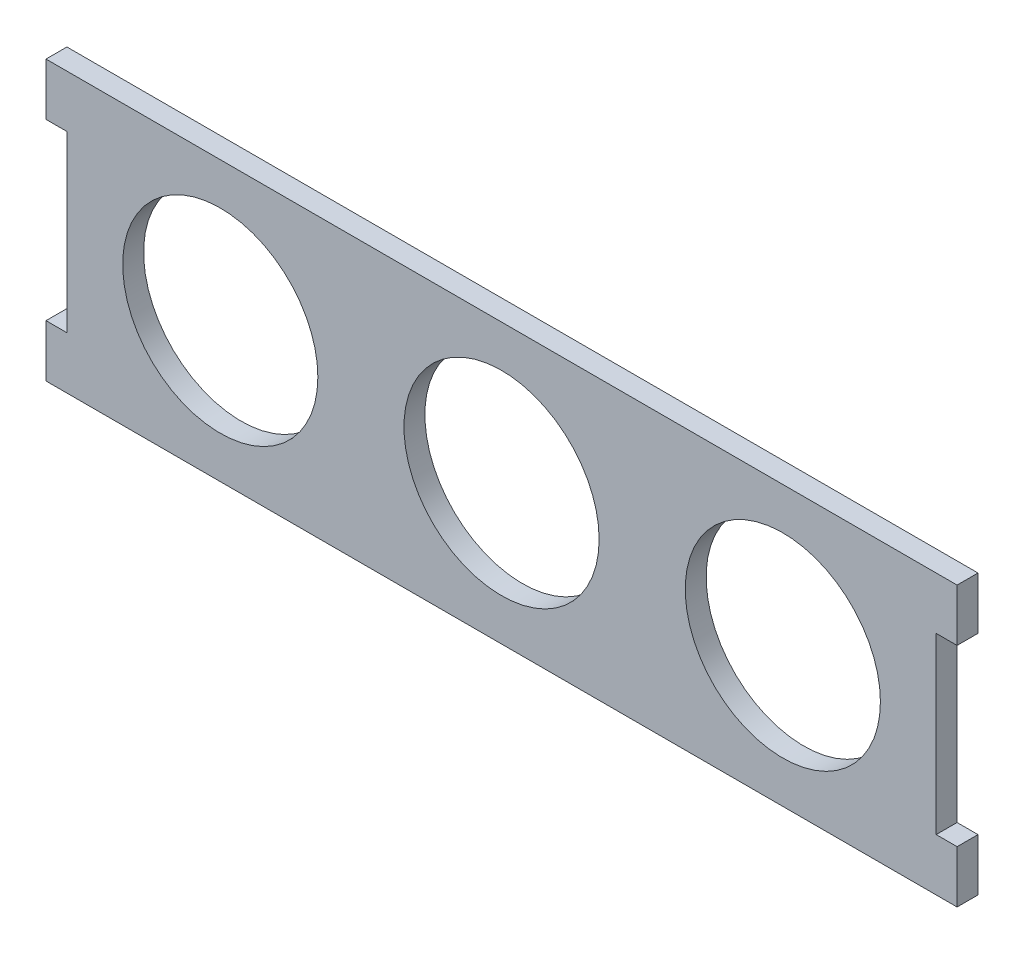
ISO-10303-21;
HEADER;
FILE_DESCRIPTION(('STEP AP214'),'2;1');
FILE_NAME('part.step','',(''),(''),'','','');
FILE_SCHEMA(('AUTOMOTIVE_DESIGN { 1 0 10303 214 1 1 1 1 }'));
ENDSEC;
DATA;
#1=APPLICATION_CONTEXT('core data for automotive mechanical design processes');
#2=APPLICATION_PROTOCOL_DEFINITION('international standard','automotive_design',2000,#1);
#3=PRODUCT_CONTEXT('',#1,'mechanical');
#4=PRODUCT('Part','Part','',(#3));
#5=PRODUCT_RELATED_PRODUCT_CATEGORY('part','',(#4));
#6=PRODUCT_DEFINITION_FORMATION('','',#4);
#7=PRODUCT_DEFINITION_CONTEXT('part definition',#1,'design');
#8=PRODUCT_DEFINITION('design','',#6,#7);
#9=PRODUCT_DEFINITION_SHAPE('','',#8);
#10=(LENGTH_UNIT() NAMED_UNIT(*) SI_UNIT(.MILLI.,.METRE.));
#11=(NAMED_UNIT(*) PLANE_ANGLE_UNIT() SI_UNIT($,.RADIAN.));
#12=(NAMED_UNIT(*) SI_UNIT($,.STERADIAN.) SOLID_ANGLE_UNIT());
#13=UNCERTAINTY_MEASURE_WITH_UNIT(LENGTH_MEASURE(1.E-05),#10,'distance_accuracy_value','');
#14=(GEOMETRIC_REPRESENTATION_CONTEXT(3) GLOBAL_UNCERTAINTY_ASSIGNED_CONTEXT((#13)) GLOBAL_UNIT_ASSIGNED_CONTEXT((#10,
#11,#12)) REPRESENTATION_CONTEXT('',''));
#15=CARTESIAN_POINT('',(0.,0.,0.));
#16=DIRECTION('',(0.,0.,1.));
#17=DIRECTION('',(1.,0.,0.));
#18=AXIS2_PLACEMENT_3D('',#15,#16,#17);
#19=CARTESIAN_POINT('',(3.,0.,3.));
#20=DIRECTION('',(1.,0.,0.));
#21=DIRECTION('',(0.,1.,0.));
#22=AXIS2_PLACEMENT_3D('',#19,#20,#21);
#23=PLANE('',#22);
#24=DIRECTION('',(0.,-1.,0.));
#25=VECTOR('',#24,1.);
#26=CARTESIAN_POINT('',(3.,0.,0.));
#27=LINE('',#26,#25);
#28=CARTESIAN_POINT('',(3.,-7.5,0.));
#29=VERTEX_POINT('',#28);
#30=CARTESIAN_POINT('',(3.,-32.5,0.));
#31=VERTEX_POINT('',#30);
#32=EDGE_CURVE('E169',#29,#31,#27,.T.);
#33=ORIENTED_EDGE('',*,*,#32,.T.);
#34=DIRECTION('',(0.,0.,-1.));
#35=VECTOR('',#34,1.);
#36=CARTESIAN_POINT('',(3.,-32.5,3.));
#37=LINE('',#36,#35);
#38=CARTESIAN_POINT('',(3.,-32.5,3.));
#39=VERTEX_POINT('',#38);
#40=EDGE_CURVE('E11',#39,#31,#37,.T.);
#41=ORIENTED_EDGE('',*,*,#40,.F.);
#42=DIRECTION('',(0.,-1.,0.));
#43=VECTOR('',#42,1.);
#44=CARTESIAN_POINT('',(3.,0.,3.));
#45=LINE('',#44,#43);
#46=CARTESIAN_POINT('',(3.,-7.5,3.));
#47=VERTEX_POINT('',#46);
#48=EDGE_CURVE('E106',#47,#39,#45,.T.);
#49=ORIENTED_EDGE('',*,*,#48,.F.);
#50=DIRECTION('',(0.,0.,-1.));
#51=VECTOR('',#50,1.);
#52=CARTESIAN_POINT('',(3.,-7.5,3.));
#53=LINE('',#52,#51);
#54=EDGE_CURVE('E159',#47,#29,#53,.T.);
#55=ORIENTED_EDGE('',*,*,#54,.T.);
#56=EDGE_LOOP('',(#33,#41,#49,#55));
#57=FACE_BOUND('',#56,.T.);
#58=ADVANCED_FACE('F38',(#57),#23,.F.);
#59=CARTESIAN_POINT('',(0.,-32.5,3.));
#60=DIRECTION('',(0.,1.,0.));
#61=DIRECTION('',(0.,0.,1.));
#62=AXIS2_PLACEMENT_3D('',#59,#60,#61);
#63=PLANE('',#62);
#64=DIRECTION('',(1.,0.,0.));
#65=VECTOR('',#64,1.);
#66=CARTESIAN_POINT('',(0.,-32.5,0.));
#67=LINE('',#66,#65);
#68=CARTESIAN_POINT('',(0.,-32.5,0.));
#69=VERTEX_POINT('',#68);
#70=EDGE_CURVE('E172',#69,#31,#67,.T.);
#71=ORIENTED_EDGE('',*,*,#70,.F.);
#72=DIRECTION('',(0.,0.,-1.));
#73=VECTOR('',#72,1.);
#74=CARTESIAN_POINT('',(0.,-32.5,3.));
#75=LINE('',#74,#73);
#76=CARTESIAN_POINT('',(0.,-32.5,3.));
#77=VERTEX_POINT('',#76);
#78=EDGE_CURVE('E47',#77,#69,#75,.T.);
#79=ORIENTED_EDGE('',*,*,#78,.F.);
#80=DIRECTION('',(1.,0.,0.));
#81=VECTOR('',#80,1.);
#82=CARTESIAN_POINT('',(0.,-32.5,3.));
#83=LINE('',#82,#81);
#84=EDGE_CURVE('E228',#77,#39,#83,.T.);
#85=ORIENTED_EDGE('',*,*,#84,.T.);
#86=ORIENTED_EDGE('',*,*,#40,.T.);
#87=EDGE_LOOP('',(#71,#79,#85,#86));
#88=FACE_BOUND('',#87,.T.);
#89=ADVANCED_FACE('F227',(#88),#63,.T.);
#90=CARTESIAN_POINT('',(0.,0.,3.));
#91=DIRECTION('',(1.,0.,0.));
#92=DIRECTION('',(0.,1.,0.));
#93=AXIS2_PLACEMENT_3D('',#90,#91,#92);
#94=PLANE('',#93);
#95=DIRECTION('',(0.,-1.,0.));
#96=VECTOR('',#95,1.);
#97=CARTESIAN_POINT('',(0.,0.,0.));
#98=LINE('',#97,#96);
#99=CARTESIAN_POINT('',(0.,-40.,0.));
#100=VERTEX_POINT('',#99);
#101=EDGE_CURVE('E175',#69,#100,#98,.T.);
#102=ORIENTED_EDGE('',*,*,#101,.T.);
#103=DIRECTION('',(0.,0.,-1.));
#104=VECTOR('',#103,1.);
#105=CARTESIAN_POINT('',(0.,-40.,3.));
#106=LINE('',#105,#104);
#107=CARTESIAN_POINT('',(0.,-40.,3.));
#108=VERTEX_POINT('',#107);
#109=EDGE_CURVE('E212',#108,#100,#106,.T.);
#110=ORIENTED_EDGE('',*,*,#109,.F.);
#111=DIRECTION('',(0.,-1.,0.));
#112=VECTOR('',#111,1.);
#113=CARTESIAN_POINT('',(0.,0.,3.));
#114=LINE('',#113,#112);
#115=EDGE_CURVE('E219',#77,#108,#114,.T.);
#116=ORIENTED_EDGE('',*,*,#115,.F.);
#117=ORIENTED_EDGE('',*,*,#78,.T.);
#118=EDGE_LOOP('',(#102,#110,#116,#117));
#119=FACE_BOUND('',#118,.T.);
#120=ADVANCED_FACE('F217',(#119),#94,.F.);
#121=CARTESIAN_POINT('',(0.,-40.,3.));
#122=DIRECTION('',(0.,1.,0.));
#123=DIRECTION('',(0.,0.,1.));
#124=AXIS2_PLACEMENT_3D('',#121,#122,#123);
#125=PLANE('',#124);
#126=DIRECTION('',(1.,0.,0.));
#127=VECTOR('',#126,1.);
#128=CARTESIAN_POINT('',(0.,-40.,0.));
#129=LINE('',#128,#127);
#130=CARTESIAN_POINT('',(130.7,-40.,0.));
#131=VERTEX_POINT('',#130);
#132=EDGE_CURVE('E177',#100,#131,#129,.T.);
#133=ORIENTED_EDGE('',*,*,#132,.T.);
#134=DIRECTION('',(0.,0.,-1.));
#135=VECTOR('',#134,1.);
#136=CARTESIAN_POINT('',(130.7,-40.,3.));
#137=LINE('',#136,#135);
#138=CARTESIAN_POINT('',(130.7,-40.,3.));
#139=VERTEX_POINT('',#138);
#140=EDGE_CURVE('E210',#139,#131,#137,.T.);
#141=ORIENTED_EDGE('',*,*,#140,.F.);
#142=DIRECTION('',(1.,0.,0.));
#143=VECTOR('',#142,1.);
#144=CARTESIAN_POINT('',(0.,-40.,3.));
#145=LINE('',#144,#143);
#146=EDGE_CURVE('E256',#108,#139,#145,.T.);
#147=ORIENTED_EDGE('',*,*,#146,.F.);
#148=ORIENTED_EDGE('',*,*,#109,.T.);
#149=EDGE_LOOP('',(#133,#141,#147,#148));
#150=FACE_BOUND('',#149,.T.);
#151=ADVANCED_FACE('F255',(#150),#125,.F.);
#152=CARTESIAN_POINT('',(130.7,0.,3.));
#153=DIRECTION('',(1.,0.,0.));
#154=DIRECTION('',(0.,0.,-1.));
#155=AXIS2_PLACEMENT_3D('',#152,#153,#154);
#156=PLANE('',#155);
#157=DIRECTION('',(0.,-1.,0.));
#158=VECTOR('',#157,1.);
#159=CARTESIAN_POINT('',(130.7,0.,0.));
#160=LINE('',#159,#158);
#161=CARTESIAN_POINT('',(130.7,-32.5,0.));
#162=VERTEX_POINT('',#161);
#163=EDGE_CURVE('E180',#162,#131,#160,.T.);
#164=ORIENTED_EDGE('',*,*,#163,.F.);
#165=DIRECTION('',(0.,0.,-1.));
#166=VECTOR('',#165,1.);
#167=CARTESIAN_POINT('',(130.7,-32.5,3.));
#168=LINE('',#167,#166);
#169=CARTESIAN_POINT('',(130.7,-32.5,3.));
#170=VERTEX_POINT('',#169);
#171=EDGE_CURVE('E208',#170,#162,#168,.T.);
#172=ORIENTED_EDGE('',*,*,#171,.F.);
#173=DIRECTION('',(0.,-1.,0.));
#174=VECTOR('',#173,1.);
#175=CARTESIAN_POINT('',(130.7,0.,3.));
#176=LINE('',#175,#174);
#177=EDGE_CURVE('E252',#170,#139,#176,.T.);
#178=ORIENTED_EDGE('',*,*,#177,.T.);
#179=ORIENTED_EDGE('',*,*,#140,.T.);
#180=EDGE_LOOP('',(#164,#172,#178,#179));
#181=FACE_BOUND('',#180,.T.);
#182=ADVANCED_FACE('F247',(#181),#156,.T.);
#183=CARTESIAN_POINT('',(0.,-32.5,3.));
#184=DIRECTION('',(0.,-1.,0.));
#185=DIRECTION('',(0.,0.,-1.));
#186=AXIS2_PLACEMENT_3D('',#183,#184,#185);
#187=PLANE('',#186);
#188=DIRECTION('',(-1.,0.,0.));
#189=VECTOR('',#188,1.);
#190=CARTESIAN_POINT('',(0.,-32.5,0.));
#191=LINE('',#190,#189);
#192=CARTESIAN_POINT('',(127.7,-32.5,0.));
#193=VERTEX_POINT('',#192);
#194=EDGE_CURVE('E183',#162,#193,#191,.T.);
#195=ORIENTED_EDGE('',*,*,#194,.T.);
#196=DIRECTION('',(0.,0.,-1.));
#197=VECTOR('',#196,1.);
#198=CARTESIAN_POINT('',(127.7,-32.5,3.));
#199=LINE('',#198,#197);
#200=CARTESIAN_POINT('',(127.7,-32.5,3.));
#201=VERTEX_POINT('',#200);
#202=EDGE_CURVE('E206',#201,#193,#199,.T.);
#203=ORIENTED_EDGE('',*,*,#202,.F.);
#204=DIRECTION('',(-1.,0.,0.));
#205=VECTOR('',#204,1.);
#206=CARTESIAN_POINT('',(0.,-32.5,3.));
#207=LINE('',#206,#205);
#208=EDGE_CURVE('E258',#170,#201,#207,.T.);
#209=ORIENTED_EDGE('',*,*,#208,.F.);
#210=ORIENTED_EDGE('',*,*,#171,.T.);
#211=EDGE_LOOP('',(#195,#203,#209,#210));
#212=FACE_BOUND('',#211,.T.);
#213=ADVANCED_FACE('F265',(#212),#187,.F.);
#214=CARTESIAN_POINT('',(127.7,0.,3.));
#215=DIRECTION('',(1.,0.,0.));
#216=DIRECTION('',(0.,0.,-1.));
#217=AXIS2_PLACEMENT_3D('',#214,#215,#216);
#218=PLANE('',#217);
#219=DIRECTION('',(0.,-1.,0.));
#220=VECTOR('',#219,1.);
#221=CARTESIAN_POINT('',(127.7,0.,0.));
#222=LINE('',#221,#220);
#223=CARTESIAN_POINT('',(127.7,-7.5,0.));
#224=VERTEX_POINT('',#223);
#225=EDGE_CURVE('E186',#224,#193,#222,.T.);
#226=ORIENTED_EDGE('',*,*,#225,.F.);
#227=DIRECTION('',(0.,0.,-1.));
#228=VECTOR('',#227,1.);
#229=CARTESIAN_POINT('',(127.7,-7.5,3.));
#230=LINE('',#229,#228);
#231=CARTESIAN_POINT('',(127.7,-7.5,3.));
#232=VERTEX_POINT('',#231);
#233=EDGE_CURVE('E204',#232,#224,#230,.T.);
#234=ORIENTED_EDGE('',*,*,#233,.F.);
#235=DIRECTION('',(0.,-1.,0.));
#236=VECTOR('',#235,1.);
#237=CARTESIAN_POINT('',(127.7,0.,3.));
#238=LINE('',#237,#236);
#239=EDGE_CURVE('E264',#232,#201,#238,.T.);
#240=ORIENTED_EDGE('',*,*,#239,.T.);
#241=ORIENTED_EDGE('',*,*,#202,.T.);
#242=EDGE_LOOP('',(#226,#234,#240,#241));
#243=FACE_BOUND('',#242,.T.);
#244=ADVANCED_FACE('F241',(#243),#218,.T.);
#245=CARTESIAN_POINT('',(0.,-7.5,3.));
#246=DIRECTION('',(0.,-1.,0.));
#247=DIRECTION('',(0.,0.,-1.));
#248=AXIS2_PLACEMENT_3D('',#245,#246,#247);
#249=PLANE('',#248);
#250=DIRECTION('',(-1.,0.,0.));
#251=VECTOR('',#250,1.);
#252=CARTESIAN_POINT('',(0.,-7.5,0.));
#253=LINE('',#252,#251);
#254=CARTESIAN_POINT('',(130.7,-7.5,0.));
#255=VERTEX_POINT('',#254);
#256=EDGE_CURVE('E189',#255,#224,#253,.T.);
#257=ORIENTED_EDGE('',*,*,#256,.F.);
#258=DIRECTION('',(0.,0.,-1.));
#259=VECTOR('',#258,1.);
#260=CARTESIAN_POINT('',(130.7,-7.5,3.));
#261=LINE('',#260,#259);
#262=CARTESIAN_POINT('',(130.7,-7.5,3.));
#263=VERTEX_POINT('',#262);
#264=EDGE_CURVE('E202',#263,#255,#261,.T.);
#265=ORIENTED_EDGE('',*,*,#264,.F.);
#266=DIRECTION('',(-1.,0.,0.));
#267=VECTOR('',#266,1.);
#268=CARTESIAN_POINT('',(0.,-7.5,3.));
#269=LINE('',#268,#267);
#270=EDGE_CURVE('E154',#263,#232,#269,.T.);
#271=ORIENTED_EDGE('',*,*,#270,.T.);
#272=ORIENTED_EDGE('',*,*,#233,.T.);
#273=EDGE_LOOP('',(#257,#265,#271,#272));
#274=FACE_BOUND('',#273,.T.);
#275=ADVANCED_FACE('F236',(#274),#249,.T.);
#276=CARTESIAN_POINT('',(130.7,0.,3.));
#277=DIRECTION('',(1.,0.,0.));
#278=DIRECTION('',(0.,0.,-1.));
#279=AXIS2_PLACEMENT_3D('',#276,#277,#278);
#280=PLANE('',#279);
#281=DIRECTION('',(0.,-1.,0.));
#282=VECTOR('',#281,1.);
#283=CARTESIAN_POINT('',(130.7,0.,0.));
#284=LINE('',#283,#282);
#285=CARTESIAN_POINT('',(130.7,0.,0.));
#286=VERTEX_POINT('',#285);
#287=EDGE_CURVE('E192',#286,#255,#284,.T.);
#288=ORIENTED_EDGE('',*,*,#287,.F.);
#289=DIRECTION('',(0.,0.,-1.));
#290=VECTOR('',#289,1.);
#291=CARTESIAN_POINT('',(130.7,0.,3.));
#292=LINE('',#291,#290);
#293=CARTESIAN_POINT('',(130.7,0.,3.));
#294=VERTEX_POINT('',#293);
#295=EDGE_CURVE('E142',#294,#286,#292,.T.);
#296=ORIENTED_EDGE('',*,*,#295,.F.);
#297=DIRECTION('',(0.,-1.,0.));
#298=VECTOR('',#297,1.);
#299=CARTESIAN_POINT('',(130.7,0.,3.));
#300=LINE('',#299,#298);
#301=EDGE_CURVE('E152',#294,#263,#300,.T.);
#302=ORIENTED_EDGE('',*,*,#301,.T.);
#303=ORIENTED_EDGE('',*,*,#264,.T.);
#304=EDGE_LOOP('',(#288,#296,#302,#303));
#305=FACE_BOUND('',#304,.T.);
#306=ADVANCED_FACE('F233',(#305),#280,.T.);
#307=CARTESIAN_POINT('',(0.,0.,3.));
#308=DIRECTION('',(0.,1.,0.));
#309=DIRECTION('',(0.,0.,1.));
#310=AXIS2_PLACEMENT_3D('',#307,#308,#309);
#311=PLANE('',#310);
#312=DIRECTION('',(1.,0.,0.));
#313=VECTOR('',#312,1.);
#314=CARTESIAN_POINT('',(0.,0.,0.));
#315=LINE('',#314,#313);
#316=CARTESIAN_POINT('',(0.,0.,0.));
#317=VERTEX_POINT('',#316);
#318=EDGE_CURVE('E141',#317,#286,#315,.T.);
#319=ORIENTED_EDGE('',*,*,#318,.F.);
#320=DIRECTION('',(0.,0.,-1.));
#321=VECTOR('',#320,1.);
#322=CARTESIAN_POINT('',(0.,0.,3.));
#323=LINE('',#322,#321);
#324=CARTESIAN_POINT('',(0.,0.,3.));
#325=VERTEX_POINT('',#324);
#326=EDGE_CURVE('E135',#325,#317,#323,.T.);
#327=ORIENTED_EDGE('',*,*,#326,.F.);
#328=DIRECTION('',(1.,0.,0.));
#329=VECTOR('',#328,1.);
#330=CARTESIAN_POINT('',(0.,0.,3.));
#331=LINE('',#330,#329);
#332=EDGE_CURVE('E139',#325,#294,#331,.T.);
#333=ORIENTED_EDGE('',*,*,#332,.T.);
#334=ORIENTED_EDGE('',*,*,#295,.T.);
#335=EDGE_LOOP('',(#319,#327,#333,#334));
#336=FACE_BOUND('',#335,.T.);
#337=ADVANCED_FACE('F137',(#336),#311,.T.);
#338=CARTESIAN_POINT('',(0.,0.,3.));
#339=DIRECTION('',(1.,0.,0.));
#340=DIRECTION('',(0.,1.,0.));
#341=AXIS2_PLACEMENT_3D('',#338,#339,#340);
#342=PLANE('',#341);
#343=DIRECTION('',(0.,-1.,0.));
#344=VECTOR('',#343,1.);
#345=CARTESIAN_POINT('',(0.,0.,0.));
#346=LINE('',#345,#344);
#347=CARTESIAN_POINT('',(0.,-7.5,0.));
#348=VERTEX_POINT('',#347);
#349=EDGE_CURVE('E94',#317,#348,#346,.T.);
#350=ORIENTED_EDGE('',*,*,#349,.T.);
#351=DIRECTION('',(0.,0.,-1.));
#352=VECTOR('',#351,1.);
#353=CARTESIAN_POINT('',(0.,-7.5,3.));
#354=LINE('',#353,#352);
#355=CARTESIAN_POINT('',(0.,-7.5,3.));
#356=VERTEX_POINT('',#355);
#357=EDGE_CURVE('E143',#356,#348,#354,.T.);
#358=ORIENTED_EDGE('',*,*,#357,.F.);
#359=DIRECTION('',(0.,-1.,0.));
#360=VECTOR('',#359,1.);
#361=CARTESIAN_POINT('',(0.,0.,3.));
#362=LINE('',#361,#360);
#363=EDGE_CURVE('E145',#325,#356,#362,.T.);
#364=ORIENTED_EDGE('',*,*,#363,.F.);
#365=ORIENTED_EDGE('',*,*,#326,.T.);
#366=EDGE_LOOP('',(#350,#358,#364,#365));
#367=FACE_BOUND('',#366,.T.);
#368=ADVANCED_FACE('F146',(#367),#342,.F.);
#369=CARTESIAN_POINT('',(105.7,-20.,3.));
#370=DIRECTION('',(0.,0.,-1.));
#371=DIRECTION('',(-1.,0.,0.));
#372=AXIS2_PLACEMENT_3D('',#369,#370,#371);
#373=CYLINDRICAL_SURFACE('',#372,14.);
#374=CARTESIAN_POINT('',(105.7,-20.,3.));
#375=DIRECTION('',(0.,0.,1.));
#376=DIRECTION('',(1.,0.,0.));
#377=AXIS2_PLACEMENT_3D('',#374,#375,#376);
#378=CIRCLE('',#377,14.);
#379=CARTESIAN_POINT('',(119.7,-20.,3.));
#380=VERTEX_POINT('',#379);
#381=EDGE_CURVE('E431',#380,#380,#378,.T.);
#382=ORIENTED_EDGE('',*,*,#381,.T.);
#383=EDGE_LOOP('',(#382));
#384=FACE_BOUND('',#383,.T.);
#385=CARTESIAN_POINT('',(105.7,-20.,0.));
#386=DIRECTION('',(0.,0.,1.));
#387=DIRECTION('',(1.,0.,0.));
#388=AXIS2_PLACEMENT_3D('',#385,#386,#387);
#389=CIRCLE('',#388,14.);
#390=CARTESIAN_POINT('',(119.7,-20.,0.));
#391=VERTEX_POINT('',#390);
#392=EDGE_CURVE('E166',#391,#391,#389,.T.);
#393=ORIENTED_EDGE('',*,*,#392,.F.);
#394=EDGE_LOOP('',(#393));
#395=FACE_BOUND('',#394,.T.);
#396=ADVANCED_FACE('F282',(#384,#395),#373,.F.);
#397=CARTESIAN_POINT('',(65.35,-20.,3.));
#398=DIRECTION('',(0.,0.,-1.));
#399=DIRECTION('',(-1.,0.,0.));
#400=AXIS2_PLACEMENT_3D('',#397,#398,#399);
#401=CYLINDRICAL_SURFACE('',#400,14.);
#402=CARTESIAN_POINT('',(65.35,-20.,3.));
#403=DIRECTION('',(0.,0.,1.));
#404=DIRECTION('',(1.,0.,0.));
#405=AXIS2_PLACEMENT_3D('',#402,#403,#404);
#406=CIRCLE('',#405,14.);
#407=CARTESIAN_POINT('',(79.35,-20.,3.));
#408=VERTEX_POINT('',#407);
#409=EDGE_CURVE('E296',#408,#408,#406,.T.);
#410=ORIENTED_EDGE('',*,*,#409,.T.);
#411=EDGE_LOOP('',(#410));
#412=FACE_BOUND('',#411,.T.);
#413=CARTESIAN_POINT('',(65.35,-20.,0.));
#414=DIRECTION('',(0.,0.,1.));
#415=DIRECTION('',(1.,0.,0.));
#416=AXIS2_PLACEMENT_3D('',#413,#414,#415);
#417=CIRCLE('',#416,14.);
#418=CARTESIAN_POINT('',(79.35,-20.,0.));
#419=VERTEX_POINT('',#418);
#420=EDGE_CURVE('E163',#419,#419,#417,.T.);
#421=ORIENTED_EDGE('',*,*,#420,.F.);
#422=EDGE_LOOP('',(#421));
#423=FACE_BOUND('',#422,.T.);
#424=ADVANCED_FACE('F284',(#412,#423),#401,.F.);
#425=CARTESIAN_POINT('',(25.,-20.,3.));
#426=DIRECTION('',(0.,0.,-1.));
#427=DIRECTION('',(-1.,0.,0.));
#428=AXIS2_PLACEMENT_3D('',#425,#426,#427);
#429=CYLINDRICAL_SURFACE('',#428,14.);
#430=CARTESIAN_POINT('',(25.,-20.,3.));
#431=DIRECTION('',(0.,0.,1.));
#432=DIRECTION('',(1.,0.,0.));
#433=AXIS2_PLACEMENT_3D('',#430,#431,#432);
#434=CIRCLE('',#433,14.);
#435=CARTESIAN_POINT('',(39.,-20.,3.));
#436=VERTEX_POINT('',#435);
#437=EDGE_CURVE('E198',#436,#436,#434,.T.);
#438=ORIENTED_EDGE('',*,*,#437,.T.);
#439=EDGE_LOOP('',(#438));
#440=FACE_BOUND('',#439,.T.);
#441=CARTESIAN_POINT('',(25.,-20.,0.));
#442=DIRECTION('',(0.,0.,1.));
#443=DIRECTION('',(1.,0.,0.));
#444=AXIS2_PLACEMENT_3D('',#441,#442,#443);
#445=CIRCLE('',#444,14.);
#446=CARTESIAN_POINT('',(39.,-20.,0.));
#447=VERTEX_POINT('',#446);
#448=EDGE_CURVE('E160',#447,#447,#445,.T.);
#449=ORIENTED_EDGE('',*,*,#448,.F.);
#450=EDGE_LOOP('',(#449));
#451=FACE_BOUND('',#450,.T.);
#452=ADVANCED_FACE('F40',(#440,#451),#429,.F.);
#453=CARTESIAN_POINT('',(0.,-7.5,3.));
#454=DIRECTION('',(0.,1.,0.));
#455=DIRECTION('',(0.,0.,1.));
#456=AXIS2_PLACEMENT_3D('',#453,#454,#455);
#457=PLANE('',#456);
#458=DIRECTION('',(1.,0.,0.));
#459=VECTOR('',#458,1.);
#460=CARTESIAN_POINT('',(0.,-7.5,0.));
#461=LINE('',#460,#459);
#462=EDGE_CURVE('E100',#348,#29,#461,.T.);
#463=ORIENTED_EDGE('',*,*,#462,.T.);
#464=ORIENTED_EDGE('',*,*,#54,.F.);
#465=DIRECTION('',(1.,0.,0.));
#466=VECTOR('',#465,1.);
#467=CARTESIAN_POINT('',(0.,-7.5,3.));
#468=LINE('',#467,#466);
#469=EDGE_CURVE('E55',#356,#47,#468,.T.);
#470=ORIENTED_EDGE('',*,*,#469,.F.);
#471=ORIENTED_EDGE('',*,*,#357,.T.);
#472=EDGE_LOOP('',(#463,#464,#470,#471));
#473=FACE_BOUND('',#472,.T.);
#474=ADVANCED_FACE('F291',(#473),#457,.F.);
#475=CARTESIAN_POINT('',(0.,0.,3.));
#476=DIRECTION('',(0.,0.,1.));
#477=DIRECTION('',(1.,0.,0.));
#478=AXIS2_PLACEMENT_3D('',#475,#476,#477);
#479=PLANE('',#478);
#480=ORIENTED_EDGE('',*,*,#437,.F.);
#481=EDGE_LOOP('',(#480));
#482=FACE_BOUND('',#481,.T.);
#483=ORIENTED_EDGE('',*,*,#409,.F.);
#484=EDGE_LOOP('',(#483));
#485=FACE_BOUND('',#484,.T.);
#486=ORIENTED_EDGE('',*,*,#381,.F.);
#487=EDGE_LOOP('',(#486));
#488=FACE_BOUND('',#487,.T.);
#489=ORIENTED_EDGE('',*,*,#48,.T.);
#490=ORIENTED_EDGE('',*,*,#84,.F.);
#491=ORIENTED_EDGE('',*,*,#115,.T.);
#492=ORIENTED_EDGE('',*,*,#146,.T.);
#493=ORIENTED_EDGE('',*,*,#177,.F.);
#494=ORIENTED_EDGE('',*,*,#208,.T.);
#495=ORIENTED_EDGE('',*,*,#239,.F.);
#496=ORIENTED_EDGE('',*,*,#270,.F.);
#497=ORIENTED_EDGE('',*,*,#301,.F.);
#498=ORIENTED_EDGE('',*,*,#332,.F.);
#499=ORIENTED_EDGE('',*,*,#363,.T.);
#500=ORIENTED_EDGE('',*,*,#469,.T.);
#501=EDGE_LOOP('',(#489,#490,#491,#492,#493,#494,#495,#496,#497,#498,#499,#500));
#502=FACE_BOUND('',#501,.T.);
#503=ADVANCED_FACE('F149',(#482,#485,#488,#502),#479,.T.);
#504=CARTESIAN_POINT('',(0.,0.,0.));
#505=DIRECTION('',(0.,0.,1.));
#506=DIRECTION('',(1.,0.,0.));
#507=AXIS2_PLACEMENT_3D('',#504,#505,#506);
#508=PLANE('',#507);
#509=ORIENTED_EDGE('',*,*,#448,.T.);
#510=EDGE_LOOP('',(#509));
#511=FACE_BOUND('',#510,.T.);
#512=ORIENTED_EDGE('',*,*,#420,.T.);
#513=EDGE_LOOP('',(#512));
#514=FACE_BOUND('',#513,.T.);
#515=ORIENTED_EDGE('',*,*,#392,.T.);
#516=EDGE_LOOP('',(#515));
#517=FACE_BOUND('',#516,.T.);
#518=ORIENTED_EDGE('',*,*,#32,.F.);
#519=ORIENTED_EDGE('',*,*,#462,.F.);
#520=ORIENTED_EDGE('',*,*,#349,.F.);
#521=ORIENTED_EDGE('',*,*,#318,.T.);
#522=ORIENTED_EDGE('',*,*,#287,.T.);
#523=ORIENTED_EDGE('',*,*,#256,.T.);
#524=ORIENTED_EDGE('',*,*,#225,.T.);
#525=ORIENTED_EDGE('',*,*,#194,.F.);
#526=ORIENTED_EDGE('',*,*,#163,.T.);
#527=ORIENTED_EDGE('',*,*,#132,.F.);
#528=ORIENTED_EDGE('',*,*,#101,.F.);
#529=ORIENTED_EDGE('',*,*,#70,.T.);
#530=EDGE_LOOP('',(#518,#519,#520,#521,#522,#523,#524,#525,#526,#527,#528,#529));
#531=FACE_BOUND('',#530,.T.);
#532=ADVANCED_FACE('F226',(#511,#514,#517,#531),#508,.F.);
#533=CLOSED_SHELL('',(#58,#89,#120,#151,#182,#213,#244,#275,#306,#337,#368,#396,#424,#452,#474,
#503,#532));
#534=MANIFOLD_SOLID_BREP('B2',#533);
#535=ADVANCED_BREP_SHAPE_REPRESENTATION('',(#18,#534),#14);
#536=SHAPE_DEFINITION_REPRESENTATION(#9,#535);
ENDSEC;
END-ISO-10303-21;
